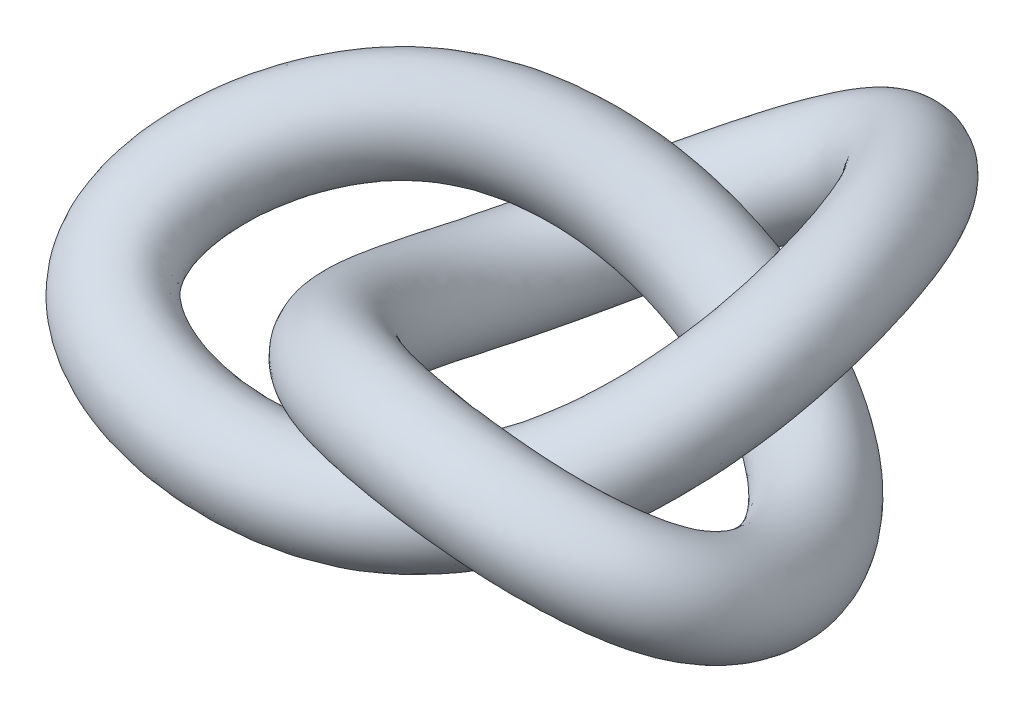
ISO-10303-21;
HEADER;
FILE_DESCRIPTION(('STEP AP214'),'2;1');
FILE_NAME('part.step','',(''),(''),'','','');
FILE_SCHEMA(('AUTOMOTIVE_DESIGN { 1 0 10303 214 1 1 1 1 }'));
ENDSEC;
DATA;
#1=APPLICATION_CONTEXT('core data for automotive mechanical design processes');
#2=APPLICATION_PROTOCOL_DEFINITION('international standard','automotive_design',2000,#1);
#3=PRODUCT_CONTEXT('',#1,'mechanical');
#4=PRODUCT('Part','Part','',(#3));
#5=PRODUCT_RELATED_PRODUCT_CATEGORY('part','',(#4));
#6=PRODUCT_DEFINITION_FORMATION('','',#4);
#7=PRODUCT_DEFINITION_CONTEXT('part definition',#1,'design');
#8=PRODUCT_DEFINITION('design','',#6,#7);
#9=PRODUCT_DEFINITION_SHAPE('','',#8);
#10=(LENGTH_UNIT() NAMED_UNIT(*) SI_UNIT(.MILLI.,.METRE.));
#11=(NAMED_UNIT(*) PLANE_ANGLE_UNIT() SI_UNIT($,.RADIAN.));
#12=(NAMED_UNIT(*) SI_UNIT($,.STERADIAN.) SOLID_ANGLE_UNIT());
#13=UNCERTAINTY_MEASURE_WITH_UNIT(LENGTH_MEASURE(1.E-05),#10,'distance_accuracy_value','');
#14=(GEOMETRIC_REPRESENTATION_CONTEXT(3) GLOBAL_UNCERTAINTY_ASSIGNED_CONTEXT((#13)) GLOBAL_UNIT_ASSIGNED_CONTEXT((#10,
#11,#12)) REPRESENTATION_CONTEXT('',''));
#15=CARTESIAN_POINT('',(0.,0.,0.));
#16=DIRECTION('',(0.,0.,1.));
#17=DIRECTION('',(1.,0.,0.));
#18=AXIS2_PLACEMENT_3D('',#15,#16,#17);
#19=CARTESIAN_POINT('',(-0.913596170067292,20.4753186077532,-11.4833123315235));
#20=CARTESIAN_POINT('',(-1.13461712836226,20.3540246371882,-11.4943057227484));
#21=CARTESIAN_POINT('',(-1.57709057615681,20.1073164785797,-11.4591975528546));
#22=CARTESIAN_POINT('',(-2.23337493750616,19.7335912347259,-11.2441112509279));
#23=CARTESIAN_POINT('',(-2.87711772481979,19.3627037761122,-10.8885039813836));
#24=CARTESIAN_POINT('',(-3.71061706025746,18.8812431696484,-10.2488810132182));
#25=CARTESIAN_POINT('',(-4.69363372170838,18.3165642095072,-9.17993747595779));
#26=CARTESIAN_POINT('',(-5.69425363881831,17.784022486348,-7.57598768188935));
#27=CARTESIAN_POINT('',(-6.30879981196301,17.5064454348761,-6.1744988565754));
#28=CARTESIAN_POINT('',(-6.62411187826667,17.4875952840384,-4.93185766803079));
#29=CARTESIAN_POINT('',(-6.78522228201082,17.6246734801279,-3.68408972958517));
#30=CARTESIAN_POINT('',(-6.69469867765032,18.1319161487331,-1.77444160723811));
#31=CARTESIAN_POINT('',(-6.01682582575322,19.0909003461531,0.441558556596133));
#32=CARTESIAN_POINT('',(-4.71127121011837,20.1575994060429,2.3168242967436));
#33=CARTESIAN_POINT('',(-3.23442691597722,20.9806695753442,3.68906453710953));
#34=CARTESIAN_POINT('',(-1.78169568016438,21.5632181818947,4.67052840167187));
#35=CARTESIAN_POINT('',(-0.248530860509434,21.9587392946241,5.39746873697709));
#36=CARTESIAN_POINT('',(0.934696426153465,22.0937642684548,5.74666954282642));
#37=CARTESIAN_POINT('',(2.16029915154791,22.1872106519114,6.06555065321978));
#38=CARTESIAN_POINT('',(3.52810876177265,22.2535475876021,6.38928503989063));
#39=CARTESIAN_POINT('',(5.26723998869288,22.0926749514656,6.47990458940663));
#40=CARTESIAN_POINT('',(6.70704790054654,21.8347505550801,6.35972420366136));
#41=CARTESIAN_POINT('',(7.83989075975606,21.5366245705582,6.09784877245488));
#42=CARTESIAN_POINT('',(8.81998031787626,21.1778629823413,5.67163554180119));
#43=CARTESIAN_POINT('',(9.48760698903756,20.8304741070455,5.15988159781608));
#44=CARTESIAN_POINT('',(9.83225019208622,20.5738191809618,4.72007275236026));
#45=CARTESIAN_POINT('',(10.0799693643315,20.3419011769888,4.29489933880667));
#46=CARTESIAN_POINT('',(10.2798261052496,20.0737189360816,3.76467076751529));
#47=CARTESIAN_POINT('',(10.3860972271395,19.7212557161273,2.99032030372904));
#48=CARTESIAN_POINT('',(10.3520199786006,19.3766476233597,2.15699946481909));
#49=CARTESIAN_POINT('',(10.1255930043506,18.9122930028685,0.923827993625441));
#50=CARTESIAN_POINT('',(9.49196449742139,18.3846914071417,-0.738879327174679));
#51=CARTESIAN_POINT('',(8.42423705414254,18.0047671846293,-2.4389562246616));
#52=CARTESIAN_POINT('',(7.37171851043824,17.9573754987799,-3.56065796146202));
#53=CARTESIAN_POINT('',(6.21262861274141,18.0989434026605,-4.49536796173613));
#54=CARTESIAN_POINT('',(4.65672948566843,18.5820095842555,-5.27264815690433));
#55=CARTESIAN_POINT('',(2.6436821546945,19.3935711984069,-5.75720730666134));
#56=CARTESIAN_POINT('',(0.593276441949345,20.3138035495789,-5.72540735552775));
#57=CARTESIAN_POINT('',(-1.42032829277986,21.1779128626972,-5.249785927662));
#58=CARTESIAN_POINT('',(-3.33706346962666,21.8819575316612,-4.4001730657359));
#59=CARTESIAN_POINT('',(-5.10461106025986,22.3694535765209,-3.23779170429013));
#60=CARTESIAN_POINT('',(-6.12679253109184,22.4510982847418,-2.19086005891253));
#61=CARTESIAN_POINT('',(-7.14954119704945,22.482886033583,-1.0864546047588));
#62=CARTESIAN_POINT('',(-8.19411654550119,22.468553732869,0.0927619114921553));
#63=CARTESIAN_POINT('',(-9.11243503172309,22.1294899651163,1.72596648984839));
#64=CARTESIAN_POINT('',(-9.57747669107525,21.7641994308768,2.97440051855625));
#65=CARTESIAN_POINT('',(-9.77519092395707,21.4624897738144,3.83859809770381));
#66=CARTESIAN_POINT('',(-9.82478926231892,21.1305397147964,4.65641908544785));
#67=CARTESIAN_POINT('',(-9.71989595501512,20.8055194012664,5.34879994252523));
#68=CARTESIAN_POINT('',(-9.53731105475219,20.5658698124498,5.79298045138224));
#69=CARTESIAN_POINT('',(-9.29279796461559,20.3271658333095,6.19853115772715));
#70=CARTESIAN_POINT('',(-8.93883858443028,20.0638522619843,6.59708396382655));
#71=CARTESIAN_POINT('',(-8.31814580515122,19.7211435119557,7.02798103572323));
#72=CARTESIAN_POINT('',(-7.57346323062367,19.3955699628432,7.358903504832));
#73=CARTESIAN_POINT('',(-6.72640280896459,19.0917632077321,7.5966997048347));
#74=CARTESIAN_POINT('',(-5.52646966808595,18.735460834199,7.78842973346343));
#75=CARTESIAN_POINT('',(-3.91124459385939,18.3700866532352,7.83152400654997));
#76=CARTESIAN_POINT('',(-1.93673691175226,18.1347973865853,7.56584971990209));
#77=CARTESIAN_POINT('',(-0.63021928261122,18.0837938446002,7.2393735034444));
#78=CARTESIAN_POINT('',(0.544718043792688,18.2370925313606,6.73864195081249));
#79=CARTESIAN_POINT('',(1.59102864886814,18.5995105679033,6.05769462411748));
#80=CARTESIAN_POINT('',(2.87218442026942,19.2556583251304,4.88302429080497));
#81=CARTESIAN_POINT('',(3.8128136145441,20.0333499462861,3.48689933679732));
#82=CARTESIAN_POINT('',(4.43298372396138,20.7960058969407,1.93686755017258));
#83=CARTESIAN_POINT('',(4.76083449944258,21.4666274208859,0.276760329339865));
#84=CARTESIAN_POINT('',(4.83023086634639,21.9987625753083,-1.45345432534166));
#85=CARTESIAN_POINT('',(4.6400645965182,22.2762069828714,-2.96939580975398));
#86=CARTESIAN_POINT('',(4.38879415112417,22.405342290707,-4.1779378151317));
#87=CARTESIAN_POINT('',(4.07124034499502,22.4734004388897,-5.40992979680192));
#88=CARTESIAN_POINT('',(3.58691038347115,22.4733400854948,-6.93632025878716));
#89=CARTESIAN_POINT('',(2.71004533575297,22.2200820635055,-8.68162429883458));
#90=CARTESIAN_POINT('',(1.8166507592386,21.8541069368369,-9.903983393528));
#91=CARTESIAN_POINT('',(1.02318622632639,21.4830231299616,-10.6622047732364));
#92=CARTESIAN_POINT('',(0.39745685111524,21.1723511792617,-11.1014375306323));
#93=CARTESIAN_POINT('',(-0.250964826386999,20.8350803019697,-11.393237205505));
#94=CARTESIAN_POINT('',(-0.692575211772323,20.5966125783182,-11.4723189402986));
#95=CARTESIAN_POINT('',(-0.913596170067292,20.4753186077532,-11.4833123315235));
#96=CARTESIAN_POINT('',(-0.950164836688505,20.4552518157938,-8.19410306356545));
#97=CARTESIAN_POINT('',(-0.951354473721421,20.4723581573365,-8.20183419980312));
#98=CARTESIAN_POINT('',(-0.959238485602139,20.5140186739035,-8.22691715625239));
#99=CARTESIAN_POINT('',(-1.12338689338921,20.5002961629524,-8.22526981872781));
#100=CARTESIAN_POINT('',(-1.40794003091094,20.4372052851906,-8.13356609045286));
#101=CARTESIAN_POINT('',(-1.91070093989281,20.3083094921144,-7.86399489944206));
#102=CARTESIAN_POINT('',(-2.68925923748938,20.1235775300144,-7.25758954782429));
#103=CARTESIAN_POINT('',(-3.58564543853511,19.9513114282905,-6.21883725632543));
#104=CARTESIAN_POINT('',(-4.23512460567933,19.9353121929503,-5.33160185278555));
#105=CARTESIAN_POINT('',(-4.44010586280681,19.9285310350356,-4.56530275494131));
#106=CARTESIAN_POINT('',(-4.42263302854023,19.9433995772511,-3.79765769898047));
#107=CARTESIAN_POINT('',(-4.06133431119631,20.0307526350373,-2.53685930246697));
#108=CARTESIAN_POINT('',(-3.19249699061969,20.2385272983509,-0.960207238653063));
#109=CARTESIAN_POINT('',(-1.90855687365467,20.3376131196492,0.513770933756241));
#110=CARTESIAN_POINT('',(-0.705742217142916,20.3455430068528,1.63555904876316));
#111=CARTESIAN_POINT('',(0.329360373933711,20.3173252443289,2.43507587278222));
#112=CARTESIAN_POINT('',(1.31028749602554,20.2635906557483,3.00669390136147));
#113=CARTESIAN_POINT('',(1.98245504899169,20.1559877374412,3.2945582690031));
#114=CARTESIAN_POINT('',(2.72440206864707,20.1934096503937,3.4946873478476));
#115=CARTESIAN_POINT('',(3.62653184495444,20.4717179632711,3.59608097031819));
#116=CARTESIAN_POINT('',(4.83626797347997,20.5540198134919,3.58539529994969));
#117=CARTESIAN_POINT('',(5.7823436714692,20.5769342835412,3.44930092918585));
#118=CARTESIAN_POINT('',(6.44095464757342,20.5436323661275,3.26972299214402));
#119=CARTESIAN_POINT('',(6.87285228205676,20.5011109990815,3.07326839987657));
#120=CARTESIAN_POINT('',(7.02589212684259,20.4965978159437,2.95341221300454));
#121=CARTESIAN_POINT('',(7.04570380074327,20.5358902755008,2.95919179143205));
#122=CARTESIAN_POINT('',(7.06527790975828,20.5701317975297,2.95632503828653));
#123=CARTESIAN_POINT('',(7.11890255217567,20.5971794672395,2.91666959007449));
#124=CARTESIAN_POINT('',(7.20509530595222,20.5722701018128,2.69186742086876));
#125=CARTESIAN_POINT('',(7.2541781481329,20.5090433166703,2.30288201254591));
#126=CARTESIAN_POINT('',(7.2315244015935,20.3967653715385,1.56361369807896));
#127=CARTESIAN_POINT('',(6.97041846978527,20.2562027476067,0.346212332313748));
#128=CARTESIAN_POINT('',(6.42415376364491,20.2326485010556,-1.01772213275249));
#129=CARTESIAN_POINT('',(5.82908578267444,20.2597994518832,-1.77155868626847));
#130=CARTESIAN_POINT('',(5.09784863976004,20.3152530602985,-2.30129888714849));
#131=CARTESIAN_POINT('',(3.93122572815211,20.3799248589513,-2.5638973650228));
#132=CARTESIAN_POINT('',(2.36314966345836,20.5659616151002,-2.65651359377999));
#133=CARTESIAN_POINT('',(0.661806050046943,20.6876682643117,-2.4168425785016));
#134=CARTESIAN_POINT('',(-1.01224878735875,20.7206893744552,-1.97620105796351));
#135=CARTESIAN_POINT('',(-2.53390387382575,20.6747159480557,-1.40758264482217));
#136=CARTESIAN_POINT('',(-3.79539095505333,20.6295777761606,-0.707544427495073));
#137=CARTESIAN_POINT('',(-4.48300283672178,20.3914783873985,-0.203453459970465));
#138=CARTESIAN_POINT('',(-5.10266594548598,20.4025663672866,0.464703515297632));
#139=CARTESIAN_POINT('',(-5.66153875981923,20.6940518409824,1.32120700635958));
#140=CARTESIAN_POINT('',(-6.23235730837403,20.6987216141671,2.51343678109397));
#141=CARTESIAN_POINT('',(-6.48376226041464,20.6717295086819,3.3243434609745));
#142=CARTESIAN_POINT('',(-6.57854735445788,20.6313759112892,3.80413987219015));
#143=CARTESIAN_POINT('',(-6.60018992468321,20.6025676833316,4.13739818718764));
#144=CARTESIAN_POINT('',(-6.58489725512379,20.6119816285219,4.28466321199407));
#145=CARTESIAN_POINT('',(-6.61053421105974,20.663798931466,4.2760681732224));
#146=CARTESIAN_POINT('',(-6.63750506125974,20.7125211287427,4.26567888741011));
#147=CARTESIAN_POINT('',(-6.66521539568588,20.7507586444278,4.27968761096815));
#148=CARTESIAN_POINT('',(-6.5643636096531,20.7369912013951,4.41317401758061));
#149=CARTESIAN_POINT('',(-6.28831020387266,20.6751141660665,4.59923177103947));
#150=CARTESIAN_POINT('',(-5.84326573854889,20.5924698533534,4.79529050098634));
#151=CARTESIAN_POINT('',(-5.09047851360252,20.48683911151,5.01945497985072));
#152=CARTESIAN_POINT('',(-3.9311185883475,20.4003360904633,5.22064118237898));
#153=CARTESIAN_POINT('',(-2.46232704359652,20.3834221904558,5.19125978418946));
#154=CARTESIAN_POINT('',(-1.51343209322127,20.507657678717,5.18354669610983));
#155=CARTESIAN_POINT('',(-0.763313776222051,20.5799583151635,4.82462153517076));
#156=CARTESIAN_POINT('',(-0.2126148390998,20.5983460973786,4.10408728723339));
#157=CARTESIAN_POINT('',(0.527958570195686,20.7320081984335,3.05572430330495));
#158=CARTESIAN_POINT('',(1.06309291812272,20.8000027272538,1.78128369304455));
#159=CARTESIAN_POINT('',(1.46063065270272,20.7855185273599,0.447333097021878));
#160=CARTESIAN_POINT('',(1.7397770660518,20.6944941813319,-0.8718852510166));
#161=CARTESIAN_POINT('',(1.89299112132148,20.587127838275,-2.10872126150318));
#162=CARTESIAN_POINT('',(1.90988382028363,20.4081097871204,-3.10444741513001));
#163=CARTESIAN_POINT('',(1.81713453908444,20.3724115139846,-3.83568987496342));
#164=CARTESIAN_POINT('',(1.62473332071531,20.4086851297445,-4.59160109479392));
#165=CARTESIAN_POINT('',(1.19091793369384,20.6177208635129,-5.60370801070307));
#166=CARTESIAN_POINT('',(0.495101740083307,20.6355741076498,-6.79840733630915));
#167=CARTESIAN_POINT('',(-0.135216763060983,20.5631536789995,-7.56315583700355));
#168=CARTESIAN_POINT('',(-0.563957188201773,20.4776735989209,-7.94738461290284));
#169=CARTESIAN_POINT('',(-0.809644284479495,20.4265379607362,-8.11518660988344));
#170=CARTESIAN_POINT('',(-0.952100663404645,20.4113806246474,-8.18053033882636));
#171=CARTESIAN_POINT('',(-0.94897519965559,20.4381454742511,-8.18637192732778));
#172=CARTESIAN_POINT('',(-0.950164836688505,20.4552518157938,-8.19410306356545));
#173=CARTESIAN_POINT('',(0.632309945756105,17.5714329735525,-8.19410306356545));
#174=CARTESIAN_POINT('',(0.643280227705719,17.5952326117087,-8.18606589071486));
#175=CARTESIAN_POINT('',(0.662648069845079,17.6523347263076,-8.17411072960988));
#176=CARTESIAN_POINT('',(0.545019090277679,17.6669624646314,-8.1171895982573));
#177=CARTESIAN_POINT('',(0.316681907715793,17.6408262368088,-7.96119880024842));
#178=CARTESIAN_POINT('',(-0.0953517142823448,17.5760221028691,-7.5961437863195));
#179=CARTESIAN_POINT('',(-0.719834697127054,17.5149017006751,-6.85662278494425));
#180=CARTESIAN_POINT('',(-1.42162946349273,17.5206333901989,-5.6924979763176));
#181=CARTESIAN_POINT('',(-1.87333740723962,17.7203910930817,-4.75461985735647));
#182=CARTESIAN_POINT('',(-2.06531842488097,17.7200330609451,-4.00519764235381));
#183=CARTESIAN_POINT('',(-2.13169926520791,17.6383310626496,-3.27693446540192));
#184=CARTESIAN_POINT('',(-2.05283045508067,17.4607216172271,-2.01994379551187));
#185=CARTESIAN_POINT('',(-1.68610089328647,17.3549294328634,-0.29555572847451));
#186=CARTESIAN_POINT('',(-1.06362161201044,17.2943837121128,1.51857517392023));
#187=CARTESIAN_POINT('',(-0.369275246342131,17.3470575506079,2.97499844224676));
#188=CARTESIAN_POINT('',(0.33582025554947,17.4386229001847,4.04215196850078));
#189=CARTESIAN_POINT('',(1.10998202348171,17.5201821315603,4.81862829189564));
#190=CARTESIAN_POINT('',(1.69372602434144,17.5251780660444,5.24888451690317));
#191=CARTESIAN_POINT('',(2.39648810635037,17.5716390795038,5.4538031949602));
#192=CARTESIAN_POINT('',(3.3229017918699,17.7003730389249,5.352064905023));
#193=CARTESIAN_POINT('',(4.47950175210653,17.6862271991361,5.1605675295313));
#194=CARTESIAN_POINT('',(5.3576672366856,17.6321402360495,4.85557948109607));
#195=CARTESIAN_POINT('',(5.9395087468551,17.5600464794496,4.56297730762721));
#196=CARTESIAN_POINT('',(6.28495832916868,17.5018416289548,4.29109099448145));
#197=CARTESIAN_POINT('',(6.36042690558615,17.502800193231,4.14354778296679));
#198=CARTESIAN_POINT('',(6.33161169759907,17.5545600301946,4.15204346705695));
#199=CARTESIAN_POINT('',(6.30628074325568,17.6022901176488,4.15515601044136));
#200=CARTESIAN_POINT('',(6.30389981363055,17.6473762186084,4.12390110204963));
#201=CARTESIAN_POINT('',(6.30758832005852,17.6531406278971,3.91533535666085));
#202=CARTESIAN_POINT('',(6.25954199488161,17.6310289993451,3.54921300235512));
#203=CARTESIAN_POINT('',(6.07945605469951,17.5978170897588,2.85763948427034));
#204=CARTESIAN_POINT('',(5.59295512503585,17.6000826111208,1.73530958954018));
#205=CARTESIAN_POINT('',(4.83307361038299,17.8124805483183,0.543591916669697));
#206=CARTESIAN_POINT('',(4.20998608844905,17.905244799853,-0.136718930390958));
#207=CARTESIAN_POINT('',(3.52194857616421,17.9243307860059,-0.683495362717732));
#208=CARTESIAN_POINT('',(2.51066916351818,17.7373707054296,-1.18437576138492));
#209=CARTESIAN_POINT('',(1.04457480511325,17.6951874204759,-1.68832974337315));
#210=CARTESIAN_POINT('',(-0.601660104435556,17.6501823706673,-2.04461785738195));
#211=CARTESIAN_POINT('',(-2.28971205791595,17.6800363903386,-2.24038015953743));
#212=CARTESIAN_POINT('',(-3.88852133806511,17.774772410532,-2.20984874281939));
#213=CARTESIAN_POINT('',(-5.22420794787602,17.8856417575125,-1.85255910138087));
#214=CARTESIAN_POINT('',(-6.0529370879427,17.8343962241032,-1.55195873754602));
#215=CARTESIAN_POINT('',(-6.64451095042237,17.8485311108784,-0.921027667990965));
#216=CARTESIAN_POINT('',(-6.98748975653616,17.940023528044,0.0792003447256985));
#217=CARTESIAN_POINT('',(-7.31992330272637,17.8371354963671,1.30300291226367));
#218=CARTESIAN_POINT('',(-7.38033079189159,17.7441179612106,2.11914464892338));
#219=CARTESIAN_POINT('',(-7.35795602921756,17.6783768220188,2.58071703826191));
#220=CARTESIAN_POINT('',(-7.28560133390841,17.6416700434727,2.87770983227909));
#221=CARTESIAN_POINT('',(-7.20830727011896,17.6587939135717,2.97612846746699));
#222=CARTESIAN_POINT('',(-7.21075072926405,17.7245887177892,2.92631919188211));
#223=CARTESIAN_POINT('',(-7.22314838469629,17.7893712445103,2.87515763643477));
#224=CARTESIAN_POINT('',(-7.24499434918997,17.8472696692434,2.8458985831841));
#225=CARTESIAN_POINT('',(-7.13231906533342,17.8643490975615,2.91383468557908));
#226=CARTESIAN_POINT('',(-6.84455588955536,17.8406501955022,3.02440310617968));
#227=CARTESIAN_POINT('',(-6.38862035468773,17.8075774823,3.13056985319668));
#228=CARTESIAN_POINT('',(-5.62671519599289,17.78190676064,3.22221704632383));
#229=CARTESIAN_POINT('',(-4.48065580249859,17.8363266657916,3.23015199633719));
#230=CARTESIAN_POINT('',(-3.04522211610367,17.9671916577698,3.02796233250774));
#231=CARTESIAN_POINT('',(-2.20397567441474,18.2843664250107,2.85806188030806));
#232=CARTESIAN_POINT('',(-1.45095288630183,18.3241564094207,2.53262361707251));
#233=CARTESIAN_POINT('',(-0.783657878484678,18.0784519547546,2.04642351691985));
#234=CARTESIAN_POINT('',(0.204574723446606,17.9878582286758,1.25124575345241));
#235=CARTESIAN_POINT('',(1.15067145192696,17.8409631746329,0.305087946888483));
#236=CARTESIAN_POINT('',(2.05252021724331,17.7463235493577,-0.715446977735522));
#237=CARTESIAN_POINT('',(2.84322725647378,17.7160842921993,-1.77864872286963));
#238=CARTESIAN_POINT('',(3.4177021288568,17.7555562822419,-2.85167233904235));
#239=CARTESIAN_POINT('',(3.74929736249155,17.7654722296527,-3.78595807674993));
#240=CARTESIAN_POINT('',(3.76148830526023,17.8004687485028,-4.49654017603145));
#241=CARTESIAN_POINT('',(3.57876644928777,17.8399421456393,-5.22388469387326));
#242=CARTESIAN_POINT('',(2.98250135256476,17.9088414120895,-6.15162179613126));
#243=CARTESIAN_POINT('',(2.15514392069036,17.8230661121763,-7.20756386289333));
#244=CARTESIAN_POINT('',(1.43586270183774,17.6850231400323,-7.83743039694818));
#245=CARTESIAN_POINT('',(0.975710785228526,17.5756339865464,-8.12035346551343));
#246=CARTESIAN_POINT('',(0.725126588274137,17.5186387431442,-8.21899971142221));
#247=CARTESIAN_POINT('',(0.596826378147396,17.5095368973708,-8.2223337667134));
#248=CARTESIAN_POINT('',(0.621339663806492,17.5476333353964,-8.20214023641604));
#249=CARTESIAN_POINT('',(0.632309945756105,17.5714329735525,-8.19410306356545));
#250=CARTESIAN_POINT('',(0.668878612377319,17.5914997655119,-11.4833123315235));
#251=CARTESIAN_POINT('',(0.460017573064881,17.4768990915603,-11.4785374136602));
#252=CARTESIAN_POINT('',(0.0447959792904108,17.2456325309838,-11.406391126212));
#253=CARTESIAN_POINT('',(-0.564968953839269,16.9002575364048,-11.1360310304574));
#254=CARTESIAN_POINT('',(-1.15249578619306,16.5663247277303,-10.7161366911791));
#255=CARTESIAN_POINT('',(-1.895267834647,16.1489557804031,-9.98102990009567));
#256=CARTESIAN_POINT('',(-2.72420918134605,15.7078883801679,-8.77897071307775));
#257=CARTESIAN_POINT('',(-3.53023766377593,15.3533444482565,-7.04964840188152));
#258=CARTESIAN_POINT('',(-3.9470126135233,15.2915243350075,-5.59751686114631));
#259=CARTESIAN_POINT('',(-4.24932444034082,15.2790973099479,-4.37175255544329));
#260=CARTESIAN_POINT('',(-4.4942885186785,15.3196049655264,-3.16336649600662));
#261=CARTESIAN_POINT('',(-4.68619482153468,15.5618851309229,-1.257526100283));
#262=CARTESIAN_POINT('',(-4.51042972841999,16.2073024806657,1.10621006677469));
#263=CARTESIAN_POINT('',(-3.86633594847413,17.1143699985065,3.32162853690758));
#264=CARTESIAN_POINT('',(-2.89795994517644,17.9821841190993,5.02850393059312));
#265=CARTESIAN_POINT('',(-1.77523579854862,18.6845158377504,6.27760449739043));
#266=CARTESIAN_POINT('',(-0.448836333053264,19.2153307704361,7.20940312751126));
#267=CARTESIAN_POINT('',(0.645967401503216,19.4629545970579,7.70099579072648));
#268=CARTESIAN_POINT('',(1.8323851892512,19.5654400810216,8.02466650033238));
#269=CARTESIAN_POINT('',(3.2244787086881,19.482202663256,8.14526897459544));
#270=CARTESIAN_POINT('',(4.91047376731944,19.2248823371098,8.05507681898824));
#271=CARTESIAN_POINT('',(6.28237146576294,18.8899565075884,7.76600275557158));
#272=CARTESIAN_POINT('',(7.33844485903774,18.5530386838803,7.39110308793807));
#273=CARTESIAN_POINT('',(8.23208636498818,18.1785936122146,6.88945813640607));
#274=CARTESIAN_POINT('',(8.82214176778113,17.8366764843328,6.35001716777832));
#275=CARTESIAN_POINT('',(9.11815808894202,17.5924889356556,5.91292442798517));
#276=CARTESIAN_POINT('',(9.32097219782887,17.3740594971079,5.4937303109615));
#277=CARTESIAN_POINT('',(9.46482336670444,17.1239156874505,4.97190227949042));
#278=CARTESIAN_POINT('',(9.48859024124579,16.8021262422116,4.21378823952113));
#279=CARTESIAN_POINT('',(9.35738382534932,16.4986333060344,3.4033304546283));
#280=CARTESIAN_POINT('',(8.97352465745662,16.1133447210888,2.21785377981682));
#281=CARTESIAN_POINT('',(8.11450115267197,15.7285712706558,0.65021793005175));
#282=CARTESIAN_POINT('',(6.83315690088062,15.584599231892,-0.877642175239418));
#283=CARTESIAN_POINT('',(5.75261881621284,15.6028208467497,-1.92581820558451));
#284=CARTESIAN_POINT('',(4.63672854914558,15.7080211283679,-2.87756443730537));
#285=CARTESIAN_POINT('',(3.23617292103451,15.9394554307338,-3.89312655326646));
#286=CARTESIAN_POINT('',(1.32510729634939,16.5227970037825,-4.7890234562545));
#287=CARTESIAN_POINT('',(-0.670189712533152,17.2763176559345,-5.35318263440811));
#288=CARTESIAN_POINT('',(-2.69779156333707,18.1372598785806,-5.51396502923593));
#289=CARTESIAN_POINT('',(-4.69168093386602,18.9820139941375,-5.20243916373311));
#290=CARTESIAN_POINT('',(-6.53342805308255,19.6255175578727,-4.38280637817593));
#291=CARTESIAN_POINT('',(-7.69672678231276,19.8940161214465,-3.53936533648808));
#292=CARTESIAN_POINT('',(-8.69138620198583,19.9288507771748,-2.47218578804739));
#293=CARTESIAN_POINT('',(-9.52006754221811,19.7145254199307,-1.14924475014173));
#294=CARTESIAN_POINT('',(-10.2000010260754,19.2679038473163,0.515532621018084));
#295=CARTESIAN_POINT('',(-10.4740452225522,18.8365878834054,1.76920170650512));
#296=CARTESIAN_POINT('',(-10.5545995987167,18.5094906845441,2.61517526377557));
#297=CARTESIAN_POINT('',(-10.5102006715441,18.1696420749376,3.3967307305393));
#298=CARTESIAN_POINT('',(-10.3433059700103,17.8523316863162,4.04026519799815));
#299=CARTESIAN_POINT('',(-10.1375275729565,17.626659598773,4.44323147004195));
#300=CARTESIAN_POINT('',(-9.87844128805214,17.4040159490772,4.80800990675181));
#301=CARTESIAN_POINT('',(-9.51861753793437,17.1603632867998,5.1632949360425));
#302=CARTESIAN_POINT('',(-8.88610126083154,16.8485014081221,5.52864170372171));
#303=CARTESIAN_POINT('',(-8.12970891630637,16.5611059922789,5.7840748399722));
#304=CARTESIAN_POINT('',(-7.27175742510344,16.3068708366787,5.93197905704503));
#305=CARTESIAN_POINT('',(-6.06270635047631,16.030528483329,5.99119179993655));
#306=CARTESIAN_POINT('',(-4.46078180801047,15.8060772285635,5.84103482050818));
#307=CARTESIAN_POINT('',(-2.51963198425941,15.7185668538993,5.40255226822037));
#308=CARTESIAN_POINT('',(-1.32076286380469,15.860502590894,4.91388868764262));
#309=CARTESIAN_POINT('',(-0.142921066287087,15.9812906256178,4.44664403271424));
#310=CARTESIAN_POINT('',(1.01998560948326,16.0796164252793,4.00003085380394));
#311=CARTESIAN_POINT('',(2.54880057352034,16.5115083553727,3.07854574095243));
#312=CARTESIAN_POINT('',(3.90039214834835,17.0743103936652,2.01070359064126));
#313=CARTESIAN_POINT('',(5.02487328850198,17.7568109189385,0.774087475415177));
#314=CARTESIAN_POINT('',(5.86428468986455,18.4882175317532,-0.630003142513167));
#315=CARTESIAN_POINT('',(6.3549418738817,19.1671910192751,-2.19640540288083));
#316=CARTESIAN_POINT('',(6.47947813872612,19.6335694254038,-3.6509064713739));
#317=CARTESIAN_POINT('',(6.33314791729997,19.8333995252251,-4.83878811619973));
#318=CARTESIAN_POINT('',(6.02527347356748,19.9046574547846,-6.04221339588126));
#319=CARTESIAN_POINT('',(5.37849380234207,19.7644606340714,-7.48423404421534));
#320=CARTESIAN_POINT('',(4.37008751636002,19.407574068032,-9.09078082541876));
#321=CARTESIAN_POINT('',(3.38773022413732,18.9759763978697,-10.1782579534726));
#322=CARTESIAN_POINT('',(2.56285419975669,18.580983517587,-10.835173625847));
#323=CARTESIAN_POINT('',(1.93222772386887,18.2644519616696,-11.2052506321711));
#324=CARTESIAN_POINT('',(1.29796221516504,17.9332365746931,-11.435040633392));
#325=CARTESIAN_POINT('',(0.877739651689758,17.7061004394634,-11.4880872493868));
#326=CARTESIAN_POINT('',(0.668878612377319,17.5914997655119,-11.4833123315235));
#327=CARTESIAN_POINT('',(0.705447278998533,17.6115665574712,-14.7725215994815));
#328=CARTESIAN_POINT('',(0.276754918424042,17.358565571412,-14.7710089366055));
#329=CARTESIAN_POINT('',(-0.573056111264257,16.83893033566,-14.6386715228142));
#330=CARTESIAN_POINT('',(-1.67495699795622,16.1335526081783,-14.1548724626575));
#331=CARTESIAN_POINT('',(-2.62167348010191,15.4918232186519,-13.4710745821099));
#332=CARTESIAN_POINT('',(-3.69518395501166,14.721889457937,-12.3659160138719));
#333=CARTESIAN_POINT('',(-4.72858366556505,13.9008750596607,-10.7013186412112));
#334=CARTESIAN_POINT('',(-5.63884586405912,13.186055506314,-8.40679882744543));
#335=CARTESIAN_POINT('',(-6.02068781980697,12.8626575769334,-6.44041386493616));
#336=CARTESIAN_POINT('',(-6.43333045580068,12.8381615589507,-4.73830746853278));
#337=CARTESIAN_POINT('',(-6.85687777214909,13.0008788684031,-3.04979852661132));
#338=CARTESIAN_POINT('',(-7.3195591879887,13.6630486446187,-0.495108405054141));
#339=CARTESIAN_POINT('',(-7.33475856355351,15.0596755284679,2.50797586202388));
#340=CARTESIAN_POINT('',(-6.66905028493783,16.9343562849002,5.12468189989493));
#341=CARTESIAN_POINT('',(-5.42664464401074,18.6173106875907,7.0820094189395));
#342=CARTESIAN_POINT('',(-3.88629185264671,19.9304087753162,8.51305702628007));
#343=CARTESIAN_POINT('',(-2.00765468958824,20.9104794093118,9.60017796312688));
#344=CARTESIAN_POINT('',(-0.401791221335005,21.4007311280715,10.1531070645498));
#345=CARTESIAN_POINT('',(1.26828227215203,21.5592410825393,10.5955298057046));
#346=CARTESIAN_POINT('',(3.1260556255063,21.264032287587,10.9384730441679));
#347=CARTESIAN_POINT('',(5.34144578253235,20.7635374750835,10.9495861084452));
#348=CARTESIAN_POINT('',(7.20707569484027,20.1477727791273,10.6764260300471));
#349=CARTESIAN_POINT('',(8.73738097122038,19.546030888311,10.2192288682489));
#350=CARTESIAN_POINT('',(10.1792144008077,18.8553455954743,9.4878252783307));
#351=CARTESIAN_POINT('',(11.2838566299761,18.1705527754347,8.55648655258986));
#352=CARTESIAN_POINT('',(11.904704480285,17.6304178411166,7.67380538891338));
#353=CARTESIAN_POINT('',(12.3356636524021,17.145828876567,6.83230461148165));
#354=CARTESIAN_POINT('',(12.6257469197783,16.6004551562927,5.81990345693122));
#355=CARTESIAN_POINT('',(12.6695921624331,15.9511118565261,4.51224112238142));
#356=CARTESIAN_POINT('',(12.455225655817,15.3662376127238,3.25744790690148));
#357=CARTESIAN_POINT('',(11.8675932602137,14.6288723524188,1.57806807536331));
#358=CARTESIAN_POINT('',(10.6360471803081,13.8570599301907,-0.434873729436678));
#359=CARTESIAN_POINT('',(8.83324019137824,13.3567179154656,-2.29887626714853));
#360=CARTESIAN_POINT('',(7.29525154397663,13.3003968936464,-3.71491748077806));
#361=CARTESIAN_POINT('',(5.75150852212696,13.4917114707298,-5.07163351189301));
#362=CARTESIAN_POINT('',(3.96167667855083,14.1415401560381,-6.60187734514798));
#363=CARTESIAN_POINT('',(1.60563978758554,15.3504065870892,-7.88971716913585));
#364=CARTESIAN_POINT('',(-0.73871932063075,16.9024529412017,-8.66174741143426));
#365=CARTESIAN_POINT('',(-3.10587106875818,18.5944833668225,-8.78754989893442));
#366=CARTESIAN_POINT('',(-5.49484052966693,20.189255577743,-8.19502958464683));
#367=CARTESIAN_POINT('',(-7.84264815828909,21.365393358233,-6.91305365497099));
#368=CARTESIAN_POINT('',(-9.34051647668281,21.9536360187898,-5.52677193543015));
#369=CARTESIAN_POINT('',(-10.7382614535493,22.0091704434713,-4.02334390810382));
#370=CARTESIAN_POINT('',(-12.0526453279001,21.4890273118173,-2.37768984500916));
#371=CARTESIAN_POINT('',(-13.0800787494245,20.6986721982654,-0.271937670227502));
#372=CARTESIAN_POINT('',(-13.5677596532128,19.9290578056003,1.41925876408686));
#373=CARTESIAN_POINT('',(-13.7512431682159,19.3406045470694,2.64963348928924));
#374=CARTESIAN_POINT('',(-13.7348000091798,18.6976141064024,3.91575162879951));
#375=CARTESIAN_POINT('',(-13.4783046699016,18.0458694590607,5.10440192852931));
#376=CARTESIAN_POINT('',(-13.0643044166489,17.5287304797568,5.96014374820179));
#377=CARTESIAN_POINT('',(-12.533734191408,17.0186606536441,6.74086217706884));
#378=CARTESIAN_POINT('',(-11.7922407266788,16.4734569043562,7.48069128890091));
#379=CARTESIAN_POINT('',(-10.6398834563297,15.8326537186828,8.14344872186432));
#380=CARTESIAN_POINT('',(-9.41486194305739,15.2815617890557,8.54374657376472));
#381=CARTESIAN_POINT('',(-8.15489449551914,14.8061641910574,8.73338826089338));
#382=CARTESIAN_POINT('',(-6.49869750495974,14.279150206018,8.76016655354926));
#383=CARTESIAN_POINT('',(-4.44090781352236,13.7758277913354,8.45191764467916));
#384=CARTESIAN_POINT('',(-1.99404185241515,13.4699420500288,7.77714220393299));
#385=CARTESIAN_POINT('',(-0.437550053194634,13.4366387567773,6.96971549497717));
#386=CARTESIAN_POINT('',(1.16511075372765,13.6384248418148,6.36066444835595));
#387=CARTESIAN_POINT('',(2.8236290974512,14.080780895804,5.95363819068804));
#388=CARTESIAN_POINT('',(4.89302642359407,15.0351584820696,4.90584572845244));
#389=CARTESIAN_POINT('',(6.65011284476973,16.3076576126975,3.71631923439403));
#390=CARTESIAN_POINT('',(7.99722635976065,17.7672982885192,2.26362192856587));
#391=CARTESIAN_POINT('',(8.88534212325532,19.2603507713072,0.518642437843298));
#392=CARTESIAN_POINT('',(9.29218161890662,20.5788257563084,-1.54113846671931));
#393=CARTESIAN_POINT('',(9.20965891496069,21.5016666211549,-3.51585486599787));
#394=CARTESIAN_POINT('',(8.90480752933969,21.8663303019475,-5.181036056368));
#395=CARTESIAN_POINT('',(8.47178049784718,21.9693727639299,-6.86054209788925));
#396=CARTESIAN_POINT('',(7.77448625211938,21.6200798560533,-8.81684629229943));
#397=CARTESIAN_POINT('',(6.58503111202969,20.9920820238878,-10.9739977879442));
#398=CARTESIAN_POINT('',(5.3395977464369,20.266929655707,-12.5190855099971));
#399=CARTESIAN_POINT('',(4.14999761428485,19.5863330486277,-13.5499937861806));
#400=CARTESIAN_POINT('',(3.13932885946361,19.010265180195,-14.19150155292));
#401=CARTESIAN_POINT('',(1.99909805218269,18.3569362520154,-14.6477475000707));
#402=CARTESIAN_POINT('',(1.13413963957302,17.8645675435304,-14.7740342623576));
#403=CARTESIAN_POINT('',(0.705447278998533,17.6115665574712,-14.7725215994815));
#404=CARTESIAN_POINT('',(-0.877027503446078,20.4953853997125,-14.7725215994815));
#405=CARTESIAN_POINT('',(-1.3178797830031,20.2356911170398,-14.7867772456937));
#406=CARTESIAN_POINT('',(-2.19494266671148,19.7006142832559,-14.6914779494567));
#407=CARTESIAN_POINT('',(-3.3433629816231,18.9668863064993,-14.262952683128));
#408=CARTESIAN_POINT('',(-4.34629541872864,18.2882022670338,-13.6434418723143));
#409=CARTESIAN_POINT('',(-5.51053318062212,17.4541768471824,-12.6337671269944));
#410=CARTESIAN_POINT('',(-6.69800820592738,16.509550889,-11.1022854040913));
#411=CARTESIAN_POINT('',(-7.8028618391015,15.6167335444056,-8.93313810745327));
#412=CARTESIAN_POINT('',(-8.38247501824669,15.0775786768019,-7.01739586036524));
#413=CARTESIAN_POINT('',(-8.80811789372652,15.0466595330412,-5.29841258112028));
#414=CARTESIAN_POINT('',(-9.1478115354814,15.3059473830047,-3.57052176018987));
#415=CARTESIAN_POINT('',(-9.32806304410433,16.2330796624289,-1.01202391200925));
#416=CARTESIAN_POINT('',(-8.84115466088674,17.9432733939553,1.84332435184533));
#417=CARTESIAN_POINT('',(-7.51398554658206,19.9775856924366,4.11987765973094));
#418=CARTESIAN_POINT('',(-5.76311161481153,21.6157961438356,5.7425700254559));
#419=CARTESIAN_POINT('',(-3.89275173426247,22.8091111194605,6.90598093056152));
#420=CARTESIAN_POINT('',(-1.80734921704441,23.6538879334998,7.78824357259271));
#421=CARTESIAN_POINT('',(-0.113062196684756,24.0315407994683,8.19878081664973));
#422=CARTESIAN_POINT('',(1.59619623444874,24.1810116534292,8.63641395859197));
#423=CARTESIAN_POINT('',(3.42968567859085,24.0353772119332,9.18248910946306));
#424=CARTESIAN_POINT('',(5.69821200390579,23.6313300894393,9.37441387886357));
#425=CARTESIAN_POINT('',(7.63175212962387,23.0925668266191,9.27014747813687));
#426=CARTESIAN_POINT('',(9.2388268719387,22.5296167749889,8.92597455276575));
#427=CARTESIAN_POINT('',(10.7671083536958,21.854614965601,8.27000268372581));
#428=CARTESIAN_POINT('',(11.9493218512325,21.1643503981474,7.36635098262761));
#429=CARTESIAN_POINT('',(12.6187965834292,20.6117480864227,6.48095371328848));
#430=CARTESIAN_POINT('',(13.0946608189047,20.1136705564479,5.63347363932681));
#431=CARTESIAN_POINT('',(13.4407496583234,19.5502584049238,4.61267194495609));
#432=CARTESIAN_POINT('',(13.5670991483268,18.8702413304418,3.28877318658932));
#433=CARTESIAN_POINT('',(13.4498618090683,18.244251930049,2.01111691709227));
#434=CARTESIAN_POINT('',(13.0196616071077,17.4278206341985,0.284042289171925));
#435=CARTESIAN_POINT('',(12.0135105250575,16.5131800666766,-1.82397098666311));
#436=CARTESIAN_POINT('',(10.4243203446402,15.7768858682029,-3.86019031657072));
#437=CARTESIAN_POINT('',(8.91435123820203,15.6549515456766,-5.34975723665557));
#438=CARTESIAN_POINT('',(7.32740858572279,15.8826337450224,-6.68943703632377));
#439=CARTESIAN_POINT('',(5.38223324318476,16.7840943095598,-7.98139894878586));
#440=CARTESIAN_POINT('',(2.92421464593065,18.2211807817135,-8.85790101954268));
#441=CARTESIAN_POINT('',(0.524746833851749,19.9399388348461,-9.03397213255391));
#442=CARTESIAN_POINT('',(-1.82840779820098,21.6351363509391,-8.52337079736049));
#443=CARTESIAN_POINT('',(-4.14022306542757,23.0891991152667,-7.39276348664962));
#444=CARTESIAN_POINT('',(-6.4138311654664,24.1093293768811,-5.76803898108519));
#445=CARTESIAN_POINT('',(-7.77058222546189,24.5107181820852,-4.1782666578546));
#446=CARTESIAN_POINT('',(-9.19641644861292,24.5632056998795,-2.63761272481522));
#447=CARTESIAN_POINT('',(-10.7266943311832,24.2430556247557,-1.13568318337527));
#448=CARTESIAN_POINT('',(-11.9925127550721,23.5602583160654,0.938496198602804));
#449=CARTESIAN_POINT('',(-12.6711911217358,22.8566693530716,2.62445757613799));
#450=CARTESIAN_POINT('',(-12.9718344934563,22.2936036363397,3.87305632321748));
#451=CARTESIAN_POINT('',(-13.0493885999546,21.6585117462612,5.17543998370806));
#452=CARTESIAN_POINT('',(-12.8548946549065,20.9990571740108,6.41293667305639));
#453=CARTESIAN_POINT('',(-12.4640878984446,20.4679406934336,7.30989272954208));
#454=CARTESIAN_POINT('',(-11.9480908679714,19.9418105378764,8.13138342804418));
#455=CARTESIAN_POINT('',(-11.2124617731747,19.3769458795407,8.91448031668497));
#456=CARTESIAN_POINT('',(-10.0719280006493,18.7052958225164,9.64278805386584));
#457=CARTESIAN_POINT('',(-8.85861625737469,18.1160257596199,10.1185752386245));
#458=CARTESIAN_POINT('',(-7.6095398793803,17.5910565621107,10.3981089086831));
#459=CARTESIAN_POINT('',(-5.96246082256937,16.9840825568881,10.5574044870761));
#460=CARTESIAN_POINT('',(-3.89137059937128,16.3398372160071,10.442406830721));
#461=CARTESIAN_POINT('',(-1.411146779908,15.8861725827148,9.94043965561471));
#462=CARTESIAN_POINT('',(0.252993527998833,15.6599300104835,9.29520031077895));
#463=CARTESIAN_POINT('',(1.85274986380743,15.8942267475576,8.65266236645421));
#464=CARTESIAN_POINT('',(3.39467213683607,16.6006750384281,8.01130196100157));
#465=CARTESIAN_POINT('',(5.21641027034315,17.7793084518273,6.71032427830498));
#466=CARTESIAN_POINT('',(6.56253431096548,19.2666971653184,5.1925149805501));
#467=CARTESIAN_POINT('',(7.40533679522005,20.8064932665215,3.42640200332327));
#468=CARTESIAN_POINT('',(7.78189193283335,22.2387606604398,1.42540590969633));
#469=CARTESIAN_POINT('',(7.7674706113713,23.4103973123415,-0.798187389180138));
#470=CARTESIAN_POINT('',(7.37024537275278,24.1443041786225,-2.83434420437794));
#471=CARTESIAN_POINT('',(6.9604537631639,24.4382730674293,-4.52018575529998));
#472=CARTESIAN_POINT('',(6.51774736927472,24.538115748035,-6.22825849880992));
#473=CARTESIAN_POINT('',(5.98290283324846,24.3289593074766,-8.26893250687125));
#474=CARTESIAN_POINT('',(4.92498893142264,23.8045900193612,-10.56484126136));
#475=CARTESIAN_POINT('',(3.76851828153817,23.1450601946743,-12.2448109500525));
#476=CARTESIAN_POINT('',(2.61032964085455,22.4883726610022,-13.37702493357));
#477=CARTESIAN_POINT('',(1.60455798670997,21.9181643977871,-14.0876884513813));
#478=CARTESIAN_POINT('',(0.450171010630647,21.2587799792919,-14.6059440721836));
#479=CARTESIAN_POINT('',(-0.436175223889057,20.7550796823852,-14.7582659532693));
#480=CARTESIAN_POINT('',(-0.877027503446078,20.4953853997125,-14.7725215994815));
#481=CARTESIAN_POINT('',(-0.913596170067292,20.4753186077532,-11.4833123315235));
#482=CARTESIAN_POINT('',(-1.13461712836226,20.3540246371882,-11.4943057227484));
#483=CARTESIAN_POINT('',(-1.57709057615681,20.1073164785797,-11.4591975528546));
#484=CARTESIAN_POINT('',(-2.23337493750616,19.7335912347259,-11.2441112509279));
#485=CARTESIAN_POINT('',(-2.87711772481979,19.3627037761122,-10.8885039813836));
#486=CARTESIAN_POINT('',(-3.71061706025746,18.8812431696484,-10.2488810132182));
#487=CARTESIAN_POINT('',(-4.69363372170838,18.3165642095072,-9.17993747595779));
#488=CARTESIAN_POINT('',(-5.69425363881831,17.784022486348,-7.57598768188935));
#489=CARTESIAN_POINT('',(-6.30879981196301,17.5064454348761,-6.1744988565754));
#490=CARTESIAN_POINT('',(-6.62411187826667,17.4875952840384,-4.93185766803079));
#491=CARTESIAN_POINT('',(-6.78522228201082,17.6246734801279,-3.68408972958517));
#492=CARTESIAN_POINT('',(-6.69469867765032,18.1319161487331,-1.77444160723811));
#493=CARTESIAN_POINT('',(-6.01682582575322,19.0909003461531,0.441558556596133));
#494=CARTESIAN_POINT('',(-4.71127121011837,20.1575994060429,2.3168242967436));
#495=CARTESIAN_POINT('',(-3.23442691597722,20.9806695753442,3.68906453710953));
#496=CARTESIAN_POINT('',(-1.78169568016438,21.5632181818947,4.67052840167187));
#497=CARTESIAN_POINT('',(-0.248530860509434,21.9587392946241,5.39746873697709));
#498=CARTESIAN_POINT('',(0.934696426153465,22.0937642684548,5.74666954282642));
#499=CARTESIAN_POINT('',(2.16029915154791,22.1872106519114,6.06555065321978));
#500=CARTESIAN_POINT('',(3.52810876177265,22.2535475876021,6.38928503989063));
#501=CARTESIAN_POINT('',(5.26723998869288,22.0926749514656,6.47990458940663));
#502=CARTESIAN_POINT('',(6.70704790054654,21.8347505550801,6.35972420366136));
#503=CARTESIAN_POINT('',(7.83989075975606,21.5366245705582,6.09784877245488));
#504=CARTESIAN_POINT('',(8.81998031787626,21.1778629823413,5.67163554180119));
#505=CARTESIAN_POINT('',(9.48760698903756,20.8304741070455,5.15988159781608));
#506=CARTESIAN_POINT('',(9.83225019208622,20.5738191809618,4.72007275236026));
#507=CARTESIAN_POINT('',(10.0799693643315,20.3419011769888,4.29489933880667));
#508=CARTESIAN_POINT('',(10.2798261052496,20.0737189360816,3.76467076751529));
#509=CARTESIAN_POINT('',(10.3860972271395,19.7212557161273,2.99032030372904));
#510=CARTESIAN_POINT('',(10.3520199786006,19.3766476233597,2.15699946481909));
#511=CARTESIAN_POINT('',(10.1255930043506,18.9122930028685,0.923827993625441));
#512=CARTESIAN_POINT('',(9.49196449742139,18.3846914071417,-0.738879327174679));
#513=CARTESIAN_POINT('',(8.42423705414254,18.0047671846293,-2.4389562246616));
#514=CARTESIAN_POINT('',(7.37171851043824,17.9573754987799,-3.56065796146202));
#515=CARTESIAN_POINT('',(6.21262861274141,18.0989434026605,-4.49536796173613));
#516=CARTESIAN_POINT('',(4.65672948566843,18.5820095842555,-5.27264815690433));
#517=CARTESIAN_POINT('',(2.6436821546945,19.3935711984069,-5.75720730666134));
#518=CARTESIAN_POINT('',(0.593276441949345,20.3138035495789,-5.72540735552775));
#519=CARTESIAN_POINT('',(-1.42032829277986,21.1779128626972,-5.249785927662));
#520=CARTESIAN_POINT('',(-3.33706346962666,21.8819575316612,-4.4001730657359));
#521=CARTESIAN_POINT('',(-5.10461106025986,22.3694535765209,-3.23779170429013));
#522=CARTESIAN_POINT('',(-6.12679253109184,22.4510982847418,-2.19086005891253));
#523=CARTESIAN_POINT('',(-7.14954119704945,22.482886033583,-1.0864546047588));
#524=CARTESIAN_POINT('',(-8.19411654550119,22.468553732869,0.0927619114921553));
#525=CARTESIAN_POINT('',(-9.11243503172309,22.1294899651163,1.72596648984839));
#526=CARTESIAN_POINT('',(-9.57747669107525,21.7641994308768,2.97440051855625));
#527=CARTESIAN_POINT('',(-9.77519092395707,21.4624897738144,3.83859809770381));
#528=CARTESIAN_POINT('',(-9.82478926231892,21.1305397147964,4.65641908544785));
#529=CARTESIAN_POINT('',(-9.71989595501512,20.8055194012664,5.34879994252523));
#530=CARTESIAN_POINT('',(-9.53731105475219,20.5658698124498,5.79298045138224));
#531=CARTESIAN_POINT('',(-9.29279796461559,20.3271658333095,6.19853115772715));
#532=CARTESIAN_POINT('',(-8.93883858443028,20.0638522619843,6.59708396382655));
#533=CARTESIAN_POINT('',(-8.31814580515122,19.7211435119557,7.02798103572323));
#534=CARTESIAN_POINT('',(-7.57346323062367,19.3955699628432,7.358903504832));
#535=CARTESIAN_POINT('',(-6.72640280896459,19.0917632077321,7.5966997048347));
#536=CARTESIAN_POINT('',(-5.52646966808595,18.735460834199,7.78842973346343));
#537=CARTESIAN_POINT('',(-3.91124459385939,18.3700866532352,7.83152400654997));
#538=CARTESIAN_POINT('',(-1.93673691175226,18.1347973865853,7.56584971990209));
#539=CARTESIAN_POINT('',(-0.63021928261122,18.0837938446002,7.2393735034444));
#540=CARTESIAN_POINT('',(0.544718043792688,18.2370925313606,6.73864195081249));
#541=CARTESIAN_POINT('',(1.59102864886814,18.5995105679033,6.05769462411748));
#542=CARTESIAN_POINT('',(2.87218442026942,19.2556583251304,4.88302429080497));
#543=CARTESIAN_POINT('',(3.8128136145441,20.0333499462861,3.48689933679732));
#544=CARTESIAN_POINT('',(4.43298372396138,20.7960058969407,1.93686755017258));
#545=CARTESIAN_POINT('',(4.76083449944258,21.4666274208859,0.276760329339865));
#546=CARTESIAN_POINT('',(4.83023086634639,21.9987625753083,-1.45345432534166));
#547=CARTESIAN_POINT('',(4.6400645965182,22.2762069828714,-2.96939580975398));
#548=CARTESIAN_POINT('',(4.38879415112417,22.405342290707,-4.1779378151317));
#549=CARTESIAN_POINT('',(4.07124034499502,22.4734004388897,-5.40992979680192));
#550=CARTESIAN_POINT('',(3.58691038347115,22.4733400854948,-6.93632025878716));
#551=CARTESIAN_POINT('',(2.71004533575297,22.2200820635055,-8.68162429883458));
#552=CARTESIAN_POINT('',(1.8166507592386,21.8541069368369,-9.903983393528));
#553=CARTESIAN_POINT('',(1.02318622632639,21.4830231299616,-10.6622047732364));
#554=CARTESIAN_POINT('',(0.39745685111524,21.1723511792617,-11.1014375306323));
#555=CARTESIAN_POINT('',(-0.250964826386999,20.8350803019697,-11.393237205505));
#556=CARTESIAN_POINT('',(-0.692575211772323,20.5966125783182,-11.4723189402986));
#557=CARTESIAN_POINT('',(-0.913596170067292,20.4753186077532,-11.4833123315235));
#558=(BOUNDED_SURFACE() B_SPLINE_SURFACE(3,3,((#19,#20,#21,#22,#23,#24,#25,#26,#27,#28,#29,#30,
#31,#32,#33,#34,#35,#36,#37,#38,#39,#40,#41,#42,#43,#44,#45,#46,#47,#48,#49,#50,#51,#52,#53,#54,
#55,#56,#57,#58,#59,#60,#61,#62,#63,#64,#65,#66,#67,#68,#69,#70,#71,#72,#73,#74,#75,#76,#77,#78,
#79,#80,#81,#82,#83,#84,#85,#86,#87,#88,#89,#90,#91,#92,#93,#94,#95),(#96,#97,#98,#99,#100,#101,
#102,#103,#104,#105,#106,#107,#108,#109,#110,#111,#112,#113,#114,#115,#116,#117,#118,#119,#120,
#121,#122,#123,#124,#125,#126,#127,#128,#129,#130,#131,#132,#133,#134,#135,#136,#137,#138,#139,
#140,#141,#142,#143,#144,#145,#146,#147,#148,#149,#150,#151,#152,#153,#154,#155,#156,#157,#158,
#159,#160,#161,#162,#163,#164,#165,#166,#167,#168,#169,#170,#171,#172),(#173,#174,#175,#176,
#177,#178,#179,#180,#181,#182,#183,#184,#185,#186,#187,#188,#189,#190,#191,#192,#193,#194,#195,
#196,#197,#198,#199,#200,#201,#202,#203,#204,#205,#206,#207,#208,#209,#210,#211,#212,#213,#214,
#215,#216,#217,#218,#219,#220,#221,#222,#223,#224,#225,#226,#227,#228,#229,#230,#231,#232,#233,
#234,#235,#236,#237,#238,#239,#240,#241,#242,#243,#244,#245,#246,#247,#248,#249),(#250,#251,
#252,#253,#254,#255,#256,#257,#258,#259,#260,#261,#262,#263,#264,#265,#266,#267,#268,#269,#270,
#271,#272,#273,#274,#275,#276,#277,#278,#279,#280,#281,#282,#283,#284,#285,#286,#287,#288,#289,
#290,#291,#292,#293,#294,#295,#296,#297,#298,#299,#300,#301,#302,#303,#304,#305,#306,#307,#308,
#309,#310,#311,#312,#313,#314,#315,#316,#317,#318,#319,#320,#321,#322,#323,#324,#325,#326),
(#327,#328,#329,#330,#331,#332,#333,#334,#335,#336,#337,#338,#339,#340,#341,#342,#343,#344,#345,
#346,#347,#348,#349,#350,#351,#352,#353,#354,#355,#356,#357,#358,#359,#360,#361,#362,#363,#364,
#365,#366,#367,#368,#369,#370,#371,#372,#373,#374,#375,#376,#377,#378,#379,#380,#381,#382,#383,
#384,#385,#386,#387,#388,#389,#390,#391,#392,#393,#394,#395,#396,#397,#398,#399,#400,#401,#402,
#403),(#404,#405,#406,#407,#408,#409,#410,#411,#412,#413,#414,#415,#416,#417,#418,#419,#420,
#421,#422,#423,#424,#425,#426,#427,#428,#429,#430,#431,#432,#433,#434,#435,#436,#437,#438,#439,
#440,#441,#442,#443,#444,#445,#446,#447,#448,#449,#450,#451,#452,#453,#454,#455,#456,#457,#458,
#459,#460,#461,#462,#463,#464,#465,#466,#467,#468,#469,#470,#471,#472,#473,#474,#475,#476,#477,
#478,#479,#480),(#481,#482,#483,#484,#485,#486,#487,#488,#489,#490,#491,#492,#493,#494,#495,
#496,#497,#498,#499,#500,#501,#502,#503,#504,#505,#506,#507,#508,#509,#510,#511,#512,#513,#514,
#515,#516,#517,#518,#519,#520,#521,#522,#523,#524,#525,#526,#527,#528,#529,#530,#531,#532,#533,
#534,#535,#536,#537,#538,#539,#540,#541,#542,#543,#544,#545,#546,#547,#548,#549,#550,#551,#552,
#553,#554,#555,#556,#557)),.UNSPECIFIED.,.T.,.T.,.F.) B_SPLINE_SURFACE_WITH_KNOTS((4,3,4),(4,1,
1,1,1,1,1,1,1,1,1,1,1,1,1,1,1,1,1,1,1,1,1,1,1,1,1,1,1,1,1,1,1,1,1,1,1,1,1,1,1,1,1,1,1,1,1,1,1,1,
1,1,1,1,1,1,1,1,1,1,1,1,1,1,1,1,1,1,1,1,1,1,1,1,4),(0.,0.5,1.),(0.,0.00878906249999999,
0.017578125,0.0263671875,0.03515625,0.052734375,0.0703125,0.087890625,0.0937911305334023,
0.10546874999999,0.123046874999999,0.1494140625,0.17578125,0.193359375,0.2109375,0.228515625,
0.243166488527126,0.246093750000016,0.263671875,0.281249999999995,0.29296875,0.3046875,
0.31640625,0.328125,0.334879412065267,0.3375,0.346875,0.35625,0.365625000000003,0.375,
0.395833333333333,0.416666666666667,0.428906480583563,0.4375,0.458333333333333,
0.479166666666667,0.5,0.520833333333333,0.541666666666667,0.562500000000007,0.582569402919911,
0.583333333333333,0.604166666666666,0.625,0.634374999999996,0.64375,0.653125,0.6625,
0.669744147675598,0.671875,0.68125,0.690625,0.7,0.709375000000008,0.71875,0.736328125,
0.75390625,0.771314613911154,0.771484375,0.789062499999993,0.806640625,0.82421875,0.841796875,
0.859375,0.876953125,0.89453125,0.904337312584187,0.912109375,0.9296875,0.947265625,0.96484375,
0.9736328125,0.982421875,0.9912109375,1.),
.UNSPECIFIED.) GEOMETRIC_REPRESENTATION_ITEM() RATIONAL_B_SPLINE_SURFACE(((1.,1.,1.,1.,1.,1.,1.,
1.,1.,1.,1.,1.,1.,1.,1.,1.,1.,1.,1.,1.,1.,1.,1.,1.,1.,1.,1.,1.,1.,1.,1.,1.,1.,1.,1.,1.,1.,1.,1.,
1.,1.,1.,1.,1.,1.,1.,1.,1.,1.,1.,1.,1.,1.,1.,1.,0.999999999999999,1.,1.,1.,1.,1.,1.,1.,1.,1.,1.,
1.,1.,1.,1.,1.,1.,1.,1.,1.,1.,1.),(0.333333333333333,0.333333333333333,0.333333333333333,
0.333333333333333,0.333333333333333,0.333333333333333,0.333333333333333,0.333333333333333,
0.333333333333333,0.333333333333333,0.333333333333333,0.333333333333333,0.333333333333333,
0.333333333333333,0.333333333333333,0.333333333333333,0.333333333333333,0.333333333333333,
0.333333333333333,0.333333333333333,0.333333333333333,0.333333333333333,0.333333333333333,
0.333333333333333,0.333333333333333,0.333333333333333,0.333333333333333,0.333333333333333,
0.333333333333333,0.333333333333333,0.333333333333333,0.333333333333333,0.333333333333333,
0.333333333333333,0.333333333333333,0.333333333333333,0.333333333333333,0.333333333333333,
0.333333333333333,0.333333333333333,0.333333333333333,0.333333333333333,0.333333333333333,
0.333333333333333,0.333333333333333,0.333333333333333,0.333333333333333,0.333333333333333,
0.333333333333333,0.333333333333333,0.333333333333333,0.333333333333333,0.333333333333333,
0.333333333333333,0.333333333333333,0.333333333333333,0.333333333333333,0.333333333333333,
0.333333333333333,0.333333333333333,0.333333333333333,0.333333333333333,0.333333333333333,
0.333333333333333,0.333333333333333,0.333333333333333,0.333333333333333,0.333333333333333,
0.333333333333333,0.333333333333333,0.333333333333333,0.333333333333333,0.333333333333333,
0.333333333333333,0.333333333333333,0.333333333333333,0.333333333333333),(0.333333333333333,
0.333333333333333,0.333333333333333,0.333333333333333,0.333333333333333,0.333333333333333,
0.333333333333333,0.333333333333333,0.333333333333333,0.333333333333333,0.333333333333333,
0.333333333333333,0.333333333333333,0.333333333333333,0.333333333333333,0.333333333333333,
0.333333333333333,0.333333333333333,0.333333333333333,0.333333333333333,0.333333333333333,
0.333333333333333,0.333333333333333,0.333333333333333,0.333333333333333,0.333333333333333,
0.333333333333333,0.333333333333333,0.333333333333333,0.333333333333333,0.333333333333333,
0.333333333333333,0.333333333333333,0.333333333333333,0.333333333333333,0.333333333333333,
0.333333333333333,0.333333333333333,0.333333333333333,0.333333333333333,0.333333333333333,
0.333333333333333,0.333333333333333,0.333333333333333,0.333333333333333,0.333333333333333,
0.333333333333333,0.333333333333333,0.333333333333333,0.333333333333333,0.333333333333333,
0.333333333333333,0.333333333333333,0.333333333333333,0.333333333333333,0.333333333333333,
0.333333333333333,0.333333333333333,0.333333333333333,0.333333333333333,0.333333333333333,
0.333333333333333,0.333333333333333,0.333333333333333,0.333333333333333,0.333333333333333,
0.333333333333333,0.333333333333333,0.333333333333333,0.333333333333333,0.333333333333333,
0.333333333333333,0.333333333333333,0.333333333333333,0.333333333333333,0.333333333333333,
0.333333333333333),(1.,1.,1.,1.,1.,1.,1.,1.,1.,1.,1.,1.,1.,1.,1.,1.,1.,1.,1.,1.,1.,1.,1.,1.,1.,
1.,1.,1.,1.,1.,1.,1.,1.,1.,1.,1.,1.,1.,1.,1.,1.,1.,1.,1.,1.,1.,1.,1.,1.,1.,1.,1.,1.,1.,1.,
0.999999999999999,1.,1.,1.,1.,1.,1.,1.,1.,1.,1.,1.,1.,1.,1.,1.,1.,1.,1.,1.,1.,1.),
(0.333333333333333,0.333333333333333,0.333333333333333,0.333333333333333,0.333333333333333,
0.333333333333333,0.333333333333333,0.333333333333333,0.333333333333333,0.333333333333333,
0.333333333333333,0.333333333333333,0.333333333333333,0.333333333333333,0.333333333333333,
0.333333333333333,0.333333333333333,0.333333333333333,0.333333333333333,0.333333333333333,
0.333333333333333,0.333333333333333,0.333333333333333,0.333333333333333,0.333333333333333,
0.333333333333333,0.333333333333333,0.333333333333333,0.333333333333333,0.333333333333333,
0.333333333333333,0.333333333333333,0.333333333333333,0.333333333333333,0.333333333333333,
0.333333333333333,0.333333333333333,0.333333333333333,0.333333333333333,0.333333333333333,
0.333333333333333,0.333333333333333,0.333333333333333,0.333333333333333,0.333333333333333,
0.333333333333333,0.333333333333333,0.333333333333333,0.333333333333333,0.333333333333333,
0.333333333333333,0.333333333333333,0.333333333333333,0.333333333333333,0.333333333333333,
0.333333333333333,0.333333333333333,0.333333333333333,0.333333333333333,0.333333333333333,
0.333333333333333,0.333333333333333,0.333333333333333,0.333333333333333,0.333333333333333,
0.333333333333333,0.333333333333333,0.333333333333333,0.333333333333333,0.333333333333333,
0.333333333333333,0.333333333333333,0.333333333333333,0.333333333333333,0.333333333333333,
0.333333333333333,0.333333333333333),(0.333333333333333,0.333333333333333,0.333333333333333,
0.333333333333333,0.333333333333333,0.333333333333333,0.333333333333333,0.333333333333333,
0.333333333333333,0.333333333333333,0.333333333333333,0.333333333333333,0.333333333333333,
0.333333333333333,0.333333333333333,0.333333333333333,0.333333333333333,0.333333333333333,
0.333333333333333,0.333333333333333,0.333333333333333,0.333333333333333,0.333333333333333,
0.333333333333333,0.333333333333333,0.333333333333333,0.333333333333333,0.333333333333333,
0.333333333333333,0.333333333333333,0.333333333333333,0.333333333333333,0.333333333333333,
0.333333333333333,0.333333333333333,0.333333333333333,0.333333333333333,0.333333333333333,
0.333333333333333,0.333333333333333,0.333333333333333,0.333333333333333,0.333333333333333,
0.333333333333333,0.333333333333333,0.333333333333333,0.333333333333333,0.333333333333333,
0.333333333333333,0.333333333333333,0.333333333333333,0.333333333333333,0.333333333333333,
0.333333333333333,0.333333333333333,0.333333333333333,0.333333333333333,0.333333333333333,
0.333333333333333,0.333333333333333,0.333333333333333,0.333333333333333,0.333333333333333,
0.333333333333333,0.333333333333333,0.333333333333333,0.333333333333333,0.333333333333333,
0.333333333333333,0.333333333333333,0.333333333333333,0.333333333333333,0.333333333333333,
0.333333333333333,0.333333333333333,0.333333333333333,0.333333333333333),(1.,1.,1.,1.,1.,1.,1.,
1.,1.,1.,1.,1.,1.,1.,1.,1.,1.,1.,1.,1.,1.,1.,1.,1.,1.,1.,1.,1.,1.,1.,1.,1.,1.,1.,1.,1.,1.,1.,1.,
1.,1.,1.,1.,1.,1.,1.,1.,1.,1.,1.,1.,1.,1.,1.,1.,0.999999999999999,1.,1.,1.,1.,1.,1.,1.,1.,1.,1.,
1.,1.,1.,1.,1.,1.,1.,1.,1.,1.,1.))) REPRESENTATION_ITEM('') SURFACE());
#559=ADVANCED_FACE('F48',(),#558,.F.);
#560=CLOSED_SHELL('',(#559));
#561=MANIFOLD_SOLID_BREP('B2',#560);
#562=ADVANCED_BREP_SHAPE_REPRESENTATION('',(#18,#561),#14);
#563=SHAPE_DEFINITION_REPRESENTATION(#9,#562);
ENDSEC;
END-ISO-10303-21;
